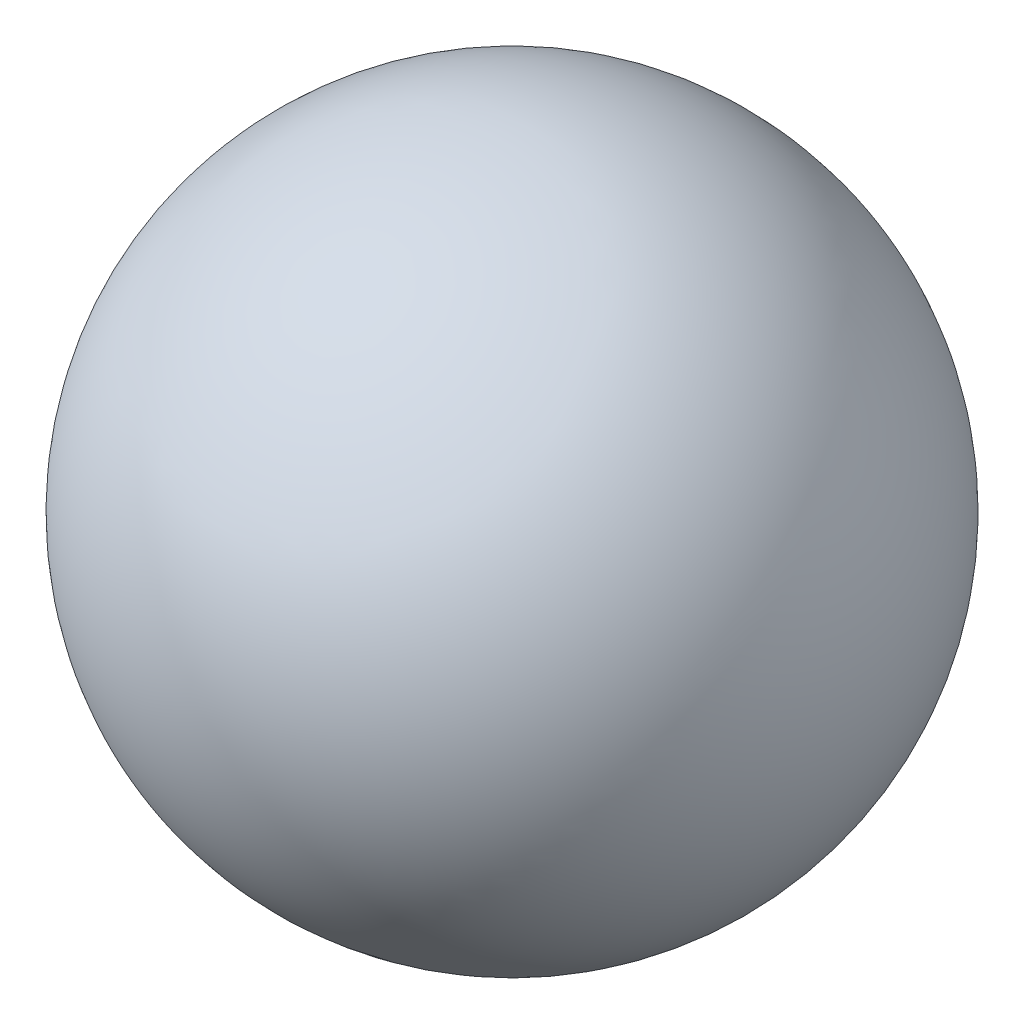
ISO-10303-21;
HEADER;
FILE_DESCRIPTION(('STEP AP214'),'2;1');
FILE_NAME('part.step','',(''),(''),'','','');
FILE_SCHEMA(('AUTOMOTIVE_DESIGN { 1 0 10303 214 1 1 1 1 }'));
ENDSEC;
DATA;
#1=APPLICATION_CONTEXT('core data for automotive mechanical design processes');
#2=APPLICATION_PROTOCOL_DEFINITION('international standard','automotive_design',2000,#1);
#3=PRODUCT_CONTEXT('',#1,'mechanical');
#4=PRODUCT('Part','Part','',(#3));
#5=PRODUCT_RELATED_PRODUCT_CATEGORY('part','',(#4));
#6=PRODUCT_DEFINITION_FORMATION('','',#4);
#7=PRODUCT_DEFINITION_CONTEXT('part definition',#1,'design');
#8=PRODUCT_DEFINITION('design','',#6,#7);
#9=PRODUCT_DEFINITION_SHAPE('','',#8);
#10=(LENGTH_UNIT() NAMED_UNIT(*) SI_UNIT(.MILLI.,.METRE.));
#11=(NAMED_UNIT(*) PLANE_ANGLE_UNIT() SI_UNIT($,.RADIAN.));
#12=(NAMED_UNIT(*) SI_UNIT($,.STERADIAN.) SOLID_ANGLE_UNIT());
#13=UNCERTAINTY_MEASURE_WITH_UNIT(LENGTH_MEASURE(1.E-05),#10,'distance_accuracy_value','');
#14=(GEOMETRIC_REPRESENTATION_CONTEXT(3) GLOBAL_UNCERTAINTY_ASSIGNED_CONTEXT((#13)) GLOBAL_UNIT_ASSIGNED_CONTEXT((#10,
#11,#12)) REPRESENTATION_CONTEXT('',''));
#15=CARTESIAN_POINT('',(0.,0.,0.));
#16=DIRECTION('',(0.,0.,1.));
#17=DIRECTION('',(1.,0.,0.));
#18=AXIS2_PLACEMENT_3D('',#15,#16,#17);
#19=CARTESIAN_POINT('',(49.75,-7.67468377589533,52.4408831846872));
#20=DIRECTION('',(0.,-0.144806720363312,0.989459960654104));
#21=DIRECTION('',(0.173648177666934,-0.974427840547316,-0.14260678090206));
#22=AXIS2_PLACEMENT_3D('',#19,#20,#21);
#23=SPHERICAL_SURFACE('',#22,5.95);
#24=CARTESIAN_POINT('',(49.75,-8.53628376205704,58.3281699505791));
#25=VERTEX_POINT('',#24);
#26=VERTEX_LOOP('',#25);
#27=FACE_BOUND('',#26,.T.);
#28=CARTESIAN_POINT('',(49.75,-6.81308378973362,46.5535964187953));
#29=VERTEX_POINT('',#28);
#30=VERTEX_LOOP('',#29);
#31=FACE_BOUND('',#30,.T.);
#32=ADVANCED_FACE('F16',(#27,#31),#23,.T.);
#33=CLOSED_SHELL('',(#32));
#34=MANIFOLD_SOLID_BREP('B1',#33);
#35=ADVANCED_BREP_SHAPE_REPRESENTATION('',(#18,#34),#14);
#36=SHAPE_DEFINITION_REPRESENTATION(#9,#35);
ENDSEC;
END-ISO-10303-21;
